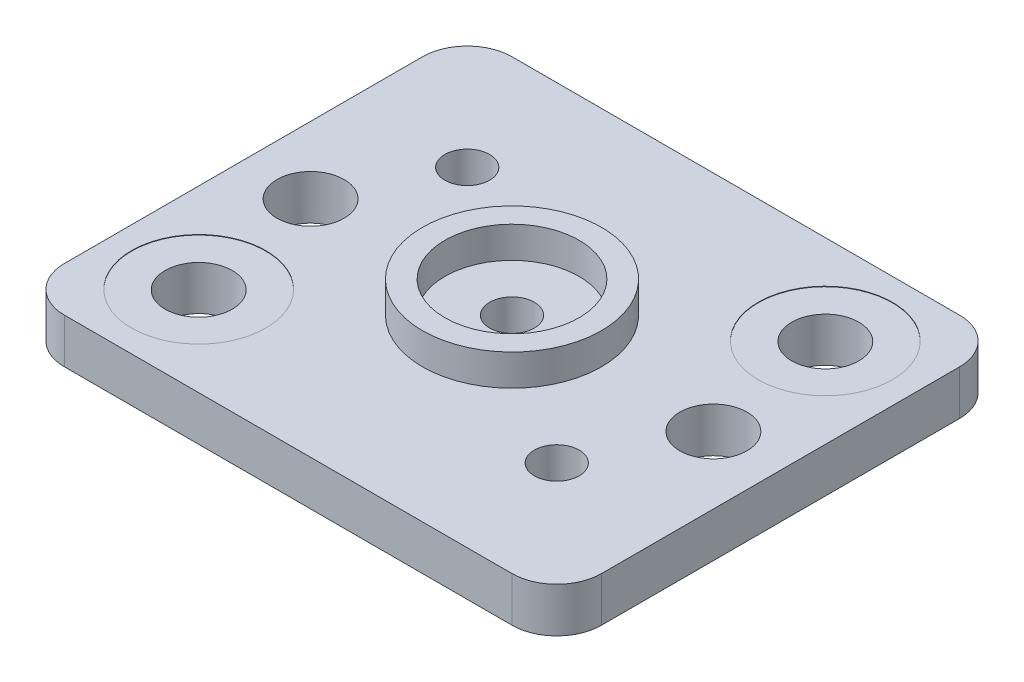
ISO-10303-21;
HEADER;
FILE_DESCRIPTION(('STEP AP214'),'2;1');
FILE_NAME('part.step','',(''),(''),'','','');
FILE_SCHEMA(('AUTOMOTIVE_DESIGN { 1 0 10303 214 1 1 1 1 }'));
ENDSEC;
DATA;
#1=APPLICATION_CONTEXT('core data for automotive mechanical design processes');
#2=APPLICATION_PROTOCOL_DEFINITION('international standard','automotive_design',2000,#1);
#3=PRODUCT_CONTEXT('',#1,'mechanical');
#4=PRODUCT('Part','Part','',(#3));
#5=PRODUCT_RELATED_PRODUCT_CATEGORY('part','',(#4));
#6=PRODUCT_DEFINITION_FORMATION('','',#4);
#7=PRODUCT_DEFINITION_CONTEXT('part definition',#1,'design');
#8=PRODUCT_DEFINITION('design','',#6,#7);
#9=PRODUCT_DEFINITION_SHAPE('','',#8);
#10=(LENGTH_UNIT() NAMED_UNIT(*) SI_UNIT(.MILLI.,.METRE.));
#11=(NAMED_UNIT(*) PLANE_ANGLE_UNIT() SI_UNIT($,.RADIAN.));
#12=(NAMED_UNIT(*) SI_UNIT($,.STERADIAN.) SOLID_ANGLE_UNIT());
#13=UNCERTAINTY_MEASURE_WITH_UNIT(LENGTH_MEASURE(1.E-05),#10,'distance_accuracy_value','');
#14=(GEOMETRIC_REPRESENTATION_CONTEXT(3) GLOBAL_UNCERTAINTY_ASSIGNED_CONTEXT((#13)) GLOBAL_UNIT_ASSIGNED_CONTEXT((#10,
#11,#12)) REPRESENTATION_CONTEXT('',''));
#15=CARTESIAN_POINT('',(0.,0.,0.));
#16=DIRECTION('',(0.,0.,1.));
#17=DIRECTION('',(1.,0.,0.));
#18=AXIS2_PLACEMENT_3D('',#15,#16,#17);
#19=CARTESIAN_POINT('',(-6.,1.,-5.));
#20=DIRECTION('',(1.,0.,0.));
#21=DIRECTION('',(0.,0.,-1.));
#22=AXIS2_PLACEMENT_3D('',#19,#20,#21);
#23=PLANE('',#22);
#24=DIRECTION('',(0.,0.,1.));
#25=VECTOR('',#24,1.);
#26=CARTESIAN_POINT('',(-6.,0.,-5.));
#27=LINE('',#26,#25);
#28=CARTESIAN_POINT('',(-6.,0.,-4.));
#29=VERTEX_POINT('',#28);
#30=CARTESIAN_POINT('',(-6.,0.,4.));
#31=VERTEX_POINT('',#30);
#32=EDGE_CURVE('E141',#29,#31,#27,.T.);
#33=ORIENTED_EDGE('',*,*,#32,.T.);
#34=DIRECTION('',(0.,-1.,0.));
#35=VECTOR('',#34,1.);
#36=CARTESIAN_POINT('',(-6.,1.,4.));
#37=LINE('',#36,#35);
#38=CARTESIAN_POINT('',(-6.,1.,4.));
#39=VERTEX_POINT('',#38);
#40=EDGE_CURVE('E163',#31,#39,#37,.F.);
#41=ORIENTED_EDGE('',*,*,#40,.T.);
#42=DIRECTION('',(0.,0.,1.));
#43=VECTOR('',#42,1.);
#44=CARTESIAN_POINT('',(-6.,1.,-5.));
#45=LINE('',#44,#43);
#46=CARTESIAN_POINT('',(-6.,1.,-4.));
#47=VERTEX_POINT('',#46);
#48=EDGE_CURVE('E139',#47,#39,#45,.T.);
#49=ORIENTED_EDGE('',*,*,#48,.F.);
#50=DIRECTION('',(0.,-1.,0.));
#51=VECTOR('',#50,1.);
#52=CARTESIAN_POINT('',(-6.,1.,-4.));
#53=LINE('',#52,#51);
#54=EDGE_CURVE('E160',#47,#29,#53,.T.);
#55=ORIENTED_EDGE('',*,*,#54,.T.);
#56=EDGE_LOOP('',(#33,#41,#49,#55));
#57=FACE_BOUND('',#56,.T.);
#58=ADVANCED_FACE('F42',(#57),#23,.F.);
#59=CARTESIAN_POINT('',(1.5,1.,5.));
#60=DIRECTION('',(0.,0.,-1.));
#61=DIRECTION('',(-1.,0.,0.));
#62=AXIS2_PLACEMENT_3D('',#59,#60,#61);
#63=PLANE('',#62);
#64=DIRECTION('',(1.,0.,0.));
#65=VECTOR('',#64,1.);
#66=CARTESIAN_POINT('',(1.5,0.,5.));
#67=LINE('',#66,#65);
#68=CARTESIAN_POINT('',(-5.,0.,5.));
#69=VERTEX_POINT('',#68);
#70=CARTESIAN_POINT('',(5.,0.,5.));
#71=VERTEX_POINT('',#70);
#72=EDGE_CURVE('E137',#69,#71,#67,.T.);
#73=ORIENTED_EDGE('',*,*,#72,.T.);
#74=DIRECTION('',(0.,-1.,0.));
#75=VECTOR('',#74,1.);
#76=CARTESIAN_POINT('',(5.,1.,5.));
#77=LINE('',#76,#75);
#78=CARTESIAN_POINT('',(5.,1.,5.));
#79=VERTEX_POINT('',#78);
#80=EDGE_CURVE('E115',#71,#79,#77,.F.);
#81=ORIENTED_EDGE('',*,*,#80,.T.);
#82=DIRECTION('',(1.,0.,0.));
#83=VECTOR('',#82,1.);
#84=CARTESIAN_POINT('',(-6.,1.,5.));
#85=LINE('',#84,#83);
#86=CARTESIAN_POINT('',(-5.,1.,5.));
#87=VERTEX_POINT('',#86);
#88=EDGE_CURVE('E209',#87,#79,#85,.T.);
#89=ORIENTED_EDGE('',*,*,#88,.F.);
#90=DIRECTION('',(0.,-1.,0.));
#91=VECTOR('',#90,1.);
#92=CARTESIAN_POINT('',(-5.,1.,5.));
#93=LINE('',#92,#91);
#94=EDGE_CURVE('E120',#87,#69,#93,.T.);
#95=ORIENTED_EDGE('',*,*,#94,.T.);
#96=EDGE_LOOP('',(#73,#81,#89,#95));
#97=FACE_BOUND('',#96,.T.);
#98=ADVANCED_FACE('F226',(#97),#63,.F.);
#99=CARTESIAN_POINT('',(6.,1.,-5.));
#100=DIRECTION('',(-1.,0.,0.));
#101=DIRECTION('',(0.,0.,1.));
#102=AXIS2_PLACEMENT_3D('',#99,#100,#101);
#103=PLANE('',#102);
#104=DIRECTION('',(0.,0.,-1.));
#105=VECTOR('',#104,1.);
#106=CARTESIAN_POINT('',(6.,1.,5.));
#107=LINE('',#106,#105);
#108=CARTESIAN_POINT('',(6.,1.,4.));
#109=VERTEX_POINT('',#108);
#110=CARTESIAN_POINT('',(6.,1.,-4.));
#111=VERTEX_POINT('',#110);
#112=EDGE_CURVE('E129',#109,#111,#107,.T.);
#113=ORIENTED_EDGE('',*,*,#112,.F.);
#114=DIRECTION('',(0.,-1.,0.));
#115=VECTOR('',#114,1.);
#116=CARTESIAN_POINT('',(6.,1.,4.));
#117=LINE('',#116,#115);
#118=CARTESIAN_POINT('',(6.,0.,4.));
#119=VERTEX_POINT('',#118);
#120=EDGE_CURVE('E114',#109,#119,#117,.T.);
#121=ORIENTED_EDGE('',*,*,#120,.T.);
#122=DIRECTION('',(0.,0.,-1.));
#123=VECTOR('',#122,1.);
#124=CARTESIAN_POINT('',(6.,0.,-5.));
#125=LINE('',#124,#123);
#126=CARTESIAN_POINT('',(6.,0.,-4.));
#127=VERTEX_POINT('',#126);
#128=EDGE_CURVE('E127',#119,#127,#125,.T.);
#129=ORIENTED_EDGE('',*,*,#128,.T.);
#130=DIRECTION('',(0.,-1.,0.));
#131=VECTOR('',#130,1.);
#132=CARTESIAN_POINT('',(6.,1.,-4.));
#133=LINE('',#132,#131);
#134=EDGE_CURVE('E131',#127,#111,#133,.F.);
#135=ORIENTED_EDGE('',*,*,#134,.T.);
#136=EDGE_LOOP('',(#113,#121,#129,#135));
#137=FACE_BOUND('',#136,.T.);
#138=ADVANCED_FACE('F126',(#137),#103,.F.);
#139=CARTESIAN_POINT('',(-6.,1.,-5.));
#140=DIRECTION('',(0.,0.,1.));
#141=DIRECTION('',(1.,0.,0.));
#142=AXIS2_PLACEMENT_3D('',#139,#140,#141);
#143=PLANE('',#142);
#144=DIRECTION('',(-1.,0.,0.));
#145=VECTOR('',#144,1.);
#146=CARTESIAN_POINT('',(-6.,1.,-5.));
#147=LINE('',#146,#145);
#148=CARTESIAN_POINT('',(5.,1.,-5.));
#149=VERTEX_POINT('',#148);
#150=CARTESIAN_POINT('',(-5.,1.,-5.));
#151=VERTEX_POINT('',#150);
#152=EDGE_CURVE('E145',#149,#151,#147,.T.);
#153=ORIENTED_EDGE('',*,*,#152,.F.);
#154=DIRECTION('',(0.,-1.,0.));
#155=VECTOR('',#154,1.);
#156=CARTESIAN_POINT('',(5.,1.,-5.));
#157=LINE('',#156,#155);
#158=CARTESIAN_POINT('',(5.,0.,-5.));
#159=VERTEX_POINT('',#158);
#160=EDGE_CURVE('E11',#149,#159,#157,.T.);
#161=ORIENTED_EDGE('',*,*,#160,.T.);
#162=DIRECTION('',(-1.,0.,0.));
#163=VECTOR('',#162,1.);
#164=CARTESIAN_POINT('',(-6.,0.,-5.));
#165=LINE('',#164,#163);
#166=CARTESIAN_POINT('',(-5.,0.,-5.));
#167=VERTEX_POINT('',#166);
#168=EDGE_CURVE('E136',#159,#167,#165,.T.);
#169=ORIENTED_EDGE('',*,*,#168,.T.);
#170=DIRECTION('',(0.,-1.,0.));
#171=VECTOR('',#170,1.);
#172=CARTESIAN_POINT('',(-5.,1.,-5.));
#173=LINE('',#172,#171);
#174=EDGE_CURVE('E51',#167,#151,#173,.F.);
#175=ORIENTED_EDGE('',*,*,#174,.T.);
#176=EDGE_LOOP('',(#153,#161,#169,#175));
#177=FACE_BOUND('',#176,.T.);
#178=ADVANCED_FACE('F233',(#177),#143,.F.);
#179=CARTESIAN_POINT('',(0.,1.,0.));
#180=DIRECTION('',(0.,1.,0.));
#181=DIRECTION('',(0.,0.,1.));
#182=AXIS2_PLACEMENT_3D('',#179,#180,#181);
#183=PLANE('',#182);
#184=CARTESIAN_POINT('',(0.,1.,0.));
#185=DIRECTION('',(0.,1.,0.));
#186=DIRECTION('',(0.,0.,1.));
#187=AXIS2_PLACEMENT_3D('',#184,#185,#186);
#188=CIRCLE('',#187,2.);
#189=CARTESIAN_POINT('',(0.,1.,2.));
#190=VERTEX_POINT('',#189);
#191=EDGE_CURVE('E333',#190,#190,#188,.T.);
#192=ORIENTED_EDGE('',*,*,#191,.F.);
#193=EDGE_LOOP('',(#192));
#194=FACE_BOUND('',#193,.T.);
#195=CARTESIAN_POINT('',(-3.36,1.,-2.36));
#196=DIRECTION('',(0.,1.,0.));
#197=DIRECTION('',(0.,0.,1.));
#198=AXIS2_PLACEMENT_3D('',#195,#196,#197);
#199=CIRCLE('',#198,0.5);
#200=CARTESIAN_POINT('',(-3.36,1.,-1.86));
#201=VERTEX_POINT('',#200);
#202=EDGE_CURVE('E338',#201,#201,#199,.T.);
#203=ORIENTED_EDGE('',*,*,#202,.F.);
#204=EDGE_LOOP('',(#203));
#205=FACE_BOUND('',#204,.T.);
#206=CARTESIAN_POINT('',(3.36,1.,2.36));
#207=DIRECTION('',(0.,1.,0.));
#208=DIRECTION('',(0.,0.,1.));
#209=AXIS2_PLACEMENT_3D('',#206,#207,#208);
#210=CIRCLE('',#209,0.5);
#211=CARTESIAN_POINT('',(3.36,1.,2.86));
#212=VERTEX_POINT('',#211);
#213=EDGE_CURVE('E344',#212,#212,#210,.T.);
#214=ORIENTED_EDGE('',*,*,#213,.F.);
#215=EDGE_LOOP('',(#214));
#216=FACE_BOUND('',#215,.T.);
#217=CARTESIAN_POINT('',(-4.5,1.,0.));
#218=DIRECTION('',(0.,1.,0.));
#219=DIRECTION('',(0.,0.,-1.));
#220=AXIS2_PLACEMENT_3D('',#217,#218,#219);
#221=CIRCLE('',#220,0.749999999999999);
#222=CARTESIAN_POINT('',(-4.5,1.,-0.749999999999999));
#223=VERTEX_POINT('',#222);
#224=EDGE_CURVE('E341',#223,#223,#221,.T.);
#225=ORIENTED_EDGE('',*,*,#224,.F.);
#226=EDGE_LOOP('',(#225));
#227=FACE_BOUND('',#226,.T.);
#228=CARTESIAN_POINT('',(4.5,1.,0.));
#229=DIRECTION('',(0.,1.,0.));
#230=DIRECTION('',(0.,0.,1.));
#231=AXIS2_PLACEMENT_3D('',#228,#229,#230);
#232=CIRCLE('',#231,0.749999999999999);
#233=CARTESIAN_POINT('',(4.5,1.,0.749999999999999));
#234=VERTEX_POINT('',#233);
#235=EDGE_CURVE('E178',#234,#234,#232,.T.);
#236=ORIENTED_EDGE('',*,*,#235,.F.);
#237=EDGE_LOOP('',(#236));
#238=FACE_BOUND('',#237,.T.);
#239=CARTESIAN_POINT('',(4.,1.,-3.));
#240=DIRECTION('',(0.,1.,0.));
#241=DIRECTION('',(0.,0.,1.));
#242=AXIS2_PLACEMENT_3D('',#239,#240,#241);
#243=CIRCLE('',#242,1.5);
#244=CARTESIAN_POINT('',(4.,1.,-1.5));
#245=VERTEX_POINT('',#244);
#246=EDGE_CURVE('E199',#245,#245,#243,.T.);
#247=ORIENTED_EDGE('',*,*,#246,.F.);
#248=EDGE_LOOP('',(#247));
#249=FACE_BOUND('',#248,.T.);
#250=CARTESIAN_POINT('',(-4.,1.,3.));
#251=DIRECTION('',(0.,1.,0.));
#252=DIRECTION('',(0.,0.,1.));
#253=AXIS2_PLACEMENT_3D('',#250,#251,#252);
#254=CIRCLE('',#253,1.5);
#255=CARTESIAN_POINT('',(-4.,1.,4.5));
#256=VERTEX_POINT('',#255);
#257=EDGE_CURVE('E173',#256,#256,#254,.T.);
#258=ORIENTED_EDGE('',*,*,#257,.F.);
#259=EDGE_LOOP('',(#258));
#260=FACE_BOUND('',#259,.T.);
#261=ORIENTED_EDGE('',*,*,#88,.T.);
#262=CARTESIAN_POINT('',(5.,1.,4.));
#263=DIRECTION('',(0.,1.,0.));
#264=DIRECTION('',(0.,0.,1.));
#265=AXIS2_PLACEMENT_3D('',#262,#263,#264);
#266=CIRCLE('',#265,1.);
#267=EDGE_CURVE('E158',#79,#109,#266,.T.);
#268=ORIENTED_EDGE('',*,*,#267,.T.);
#269=ORIENTED_EDGE('',*,*,#112,.T.);
#270=CARTESIAN_POINT('',(5.,1.,-4.));
#271=DIRECTION('',(0.,1.,0.));
#272=DIRECTION('',(0.,0.,1.));
#273=AXIS2_PLACEMENT_3D('',#270,#271,#272);
#274=CIRCLE('',#273,1.);
#275=EDGE_CURVE('E65',#111,#149,#274,.T.);
#276=ORIENTED_EDGE('',*,*,#275,.T.);
#277=ORIENTED_EDGE('',*,*,#152,.T.);
#278=CARTESIAN_POINT('',(-5.,1.,-4.));
#279=DIRECTION('',(0.,1.,0.));
#280=DIRECTION('',(0.,0.,1.));
#281=AXIS2_PLACEMENT_3D('',#278,#279,#280);
#282=CIRCLE('',#281,1.);
#283=EDGE_CURVE('E153',#151,#47,#282,.T.);
#284=ORIENTED_EDGE('',*,*,#283,.T.);
#285=ORIENTED_EDGE('',*,*,#48,.T.);
#286=CARTESIAN_POINT('',(-5.,1.,4.));
#287=DIRECTION('',(0.,1.,0.));
#288=DIRECTION('',(0.,0.,1.));
#289=AXIS2_PLACEMENT_3D('',#286,#287,#288);
#290=CIRCLE('',#289,1.);
#291=EDGE_CURVE('E156',#39,#87,#290,.T.);
#292=ORIENTED_EDGE('',*,*,#291,.T.);
#293=EDGE_LOOP('',(#261,#268,#269,#276,#277,#284,#285,#292));
#294=FACE_BOUND('',#293,.T.);
#295=ADVANCED_FACE('F224',(#194,#205,#216,#227,#238,#249,#260,#294),#183,.T.);
#296=CARTESIAN_POINT('',(0.,0.,0.));
#297=DIRECTION('',(0.,1.,0.));
#298=DIRECTION('',(0.,0.,1.));
#299=AXIS2_PLACEMENT_3D('',#296,#297,#298);
#300=PLANE('',#299);
#301=CARTESIAN_POINT('',(0.,0.,0.));
#302=DIRECTION('',(0.,1.,0.));
#303=DIRECTION('',(0.,0.,1.));
#304=AXIS2_PLACEMENT_3D('',#301,#302,#303);
#305=CIRCLE('',#304,0.5);
#306=CARTESIAN_POINT('',(0.,0.,0.5));
#307=VERTEX_POINT('',#306);
#308=EDGE_CURVE('E46',#307,#307,#305,.T.);
#309=ORIENTED_EDGE('',*,*,#308,.T.);
#310=EDGE_LOOP('',(#309));
#311=FACE_BOUND('',#310,.T.);
#312=CARTESIAN_POINT('',(-3.36,0.,-2.36));
#313=DIRECTION('',(0.,1.,0.));
#314=DIRECTION('',(0.,0.,1.));
#315=AXIS2_PLACEMENT_3D('',#312,#313,#314);
#316=CIRCLE('',#315,0.5);
#317=CARTESIAN_POINT('',(-3.36,0.,-1.86));
#318=VERTEX_POINT('',#317);
#319=EDGE_CURVE('E183',#318,#318,#316,.T.);
#320=ORIENTED_EDGE('',*,*,#319,.T.);
#321=EDGE_LOOP('',(#320));
#322=FACE_BOUND('',#321,.T.);
#323=CARTESIAN_POINT('',(3.36,0.,2.36));
#324=DIRECTION('',(0.,1.,0.));
#325=DIRECTION('',(0.,0.,1.));
#326=AXIS2_PLACEMENT_3D('',#323,#324,#325);
#327=CIRCLE('',#326,0.5);
#328=CARTESIAN_POINT('',(3.36,0.,2.86));
#329=VERTEX_POINT('',#328);
#330=EDGE_CURVE('E181',#329,#329,#327,.T.);
#331=ORIENTED_EDGE('',*,*,#330,.T.);
#332=EDGE_LOOP('',(#331));
#333=FACE_BOUND('',#332,.T.);
#334=CARTESIAN_POINT('',(-4.5,0.,0.));
#335=DIRECTION('',(0.,1.,0.));
#336=DIRECTION('',(0.,0.,1.));
#337=AXIS2_PLACEMENT_3D('',#334,#335,#336);
#338=CIRCLE('',#337,0.749999999999999);
#339=CARTESIAN_POINT('',(-4.5,0.,0.749999999999999));
#340=VERTEX_POINT('',#339);
#341=EDGE_CURVE('E177',#340,#340,#338,.T.);
#342=ORIENTED_EDGE('',*,*,#341,.T.);
#343=EDGE_LOOP('',(#342));
#344=FACE_BOUND('',#343,.T.);
#345=CARTESIAN_POINT('',(4.5,0.,0.));
#346=DIRECTION('',(0.,1.,0.));
#347=DIRECTION('',(0.,0.,1.));
#348=AXIS2_PLACEMENT_3D('',#345,#346,#347);
#349=CIRCLE('',#348,0.749999999999999);
#350=CARTESIAN_POINT('',(4.5,0.,0.749999999999999));
#351=VERTEX_POINT('',#350);
#352=EDGE_CURVE('E174',#351,#351,#349,.T.);
#353=ORIENTED_EDGE('',*,*,#352,.T.);
#354=EDGE_LOOP('',(#353));
#355=FACE_BOUND('',#354,.T.);
#356=CARTESIAN_POINT('',(4.,0.,-3.));
#357=DIRECTION('',(0.,1.,0.));
#358=DIRECTION('',(0.,0.,1.));
#359=AXIS2_PLACEMENT_3D('',#356,#357,#358);
#360=CIRCLE('',#359,0.75);
#361=CARTESIAN_POINT('',(4.,0.,-2.25));
#362=VERTEX_POINT('',#361);
#363=EDGE_CURVE('E169',#362,#362,#360,.T.);
#364=ORIENTED_EDGE('',*,*,#363,.T.);
#365=EDGE_LOOP('',(#364));
#366=FACE_BOUND('',#365,.T.);
#367=CARTESIAN_POINT('',(-4.,0.,3.));
#368=DIRECTION('',(0.,1.,0.));
#369=DIRECTION('',(0.,0.,1.));
#370=AXIS2_PLACEMENT_3D('',#367,#368,#369);
#371=CIRCLE('',#370,0.75);
#372=CARTESIAN_POINT('',(-4.,0.,3.75));
#373=VERTEX_POINT('',#372);
#374=EDGE_CURVE('E166',#373,#373,#371,.T.);
#375=ORIENTED_EDGE('',*,*,#374,.T.);
#376=EDGE_LOOP('',(#375));
#377=FACE_BOUND('',#376,.T.);
#378=ORIENTED_EDGE('',*,*,#128,.F.);
#379=CARTESIAN_POINT('',(5.,0.,4.));
#380=DIRECTION('',(0.,1.,0.));
#381=DIRECTION('',(0.,0.,1.));
#382=AXIS2_PLACEMENT_3D('',#379,#380,#381);
#383=CIRCLE('',#382,1.);
#384=EDGE_CURVE('E110',#119,#71,#383,.F.);
#385=ORIENTED_EDGE('',*,*,#384,.T.);
#386=ORIENTED_EDGE('',*,*,#72,.F.);
#387=CARTESIAN_POINT('',(-5.,0.,4.));
#388=DIRECTION('',(0.,1.,0.));
#389=DIRECTION('',(0.,0.,1.));
#390=AXIS2_PLACEMENT_3D('',#387,#388,#389);
#391=CIRCLE('',#390,1.);
#392=EDGE_CURVE('E121',#69,#31,#391,.F.);
#393=ORIENTED_EDGE('',*,*,#392,.T.);
#394=ORIENTED_EDGE('',*,*,#32,.F.);
#395=CARTESIAN_POINT('',(-5.,0.,-4.));
#396=DIRECTION('',(0.,1.,0.));
#397=DIRECTION('',(0.,0.,1.));
#398=AXIS2_PLACEMENT_3D('',#395,#396,#397);
#399=CIRCLE('',#398,1.);
#400=EDGE_CURVE('E130',#29,#167,#399,.F.);
#401=ORIENTED_EDGE('',*,*,#400,.T.);
#402=ORIENTED_EDGE('',*,*,#168,.F.);
#403=CARTESIAN_POINT('',(5.,0.,-4.));
#404=DIRECTION('',(0.,1.,0.));
#405=DIRECTION('',(0.,0.,1.));
#406=AXIS2_PLACEMENT_3D('',#403,#404,#405);
#407=CIRCLE('',#406,1.);
#408=EDGE_CURVE('E135',#159,#127,#407,.F.);
#409=ORIENTED_EDGE('',*,*,#408,.T.);
#410=EDGE_LOOP('',(#378,#385,#386,#393,#394,#401,#402,#409));
#411=FACE_BOUND('',#410,.T.);
#412=ADVANCED_FACE('F133',(#311,#322,#333,#344,#355,#366,#377,#411),#300,.F.);
#413=CARTESIAN_POINT('',(5.,1.,4.));
#414=DIRECTION('',(0.,-1.,0.));
#415=DIRECTION('',(0.,0.,-1.));
#416=AXIS2_PLACEMENT_3D('',#413,#414,#415);
#417=CYLINDRICAL_SURFACE('',#416,1.);
#418=ORIENTED_EDGE('',*,*,#267,.F.);
#419=ORIENTED_EDGE('',*,*,#80,.F.);
#420=ORIENTED_EDGE('',*,*,#384,.F.);
#421=ORIENTED_EDGE('',*,*,#120,.F.);
#422=EDGE_LOOP('',(#418,#419,#420,#421));
#423=FACE_BOUND('',#422,.T.);
#424=ADVANCED_FACE('F113',(#423),#417,.T.);
#425=CARTESIAN_POINT('',(-5.,1.,4.));
#426=DIRECTION('',(0.,-1.,0.));
#427=DIRECTION('',(0.,0.,-1.));
#428=AXIS2_PLACEMENT_3D('',#425,#426,#427);
#429=CYLINDRICAL_SURFACE('',#428,1.);
#430=ORIENTED_EDGE('',*,*,#291,.F.);
#431=ORIENTED_EDGE('',*,*,#40,.F.);
#432=ORIENTED_EDGE('',*,*,#392,.F.);
#433=ORIENTED_EDGE('',*,*,#94,.F.);
#434=EDGE_LOOP('',(#430,#431,#432,#433));
#435=FACE_BOUND('',#434,.T.);
#436=ADVANCED_FACE('F221',(#435),#429,.T.);
#437=CARTESIAN_POINT('',(5.,1.,-4.));
#438=DIRECTION('',(0.,-1.,0.));
#439=DIRECTION('',(0.,0.,-1.));
#440=AXIS2_PLACEMENT_3D('',#437,#438,#439);
#441=CYLINDRICAL_SURFACE('',#440,1.);
#442=ORIENTED_EDGE('',*,*,#275,.F.);
#443=ORIENTED_EDGE('',*,*,#134,.F.);
#444=ORIENTED_EDGE('',*,*,#408,.F.);
#445=ORIENTED_EDGE('',*,*,#160,.F.);
#446=EDGE_LOOP('',(#442,#443,#444,#445));
#447=FACE_BOUND('',#446,.T.);
#448=ADVANCED_FACE('F241',(#447),#441,.T.);
#449=CARTESIAN_POINT('',(-5.,1.,-4.));
#450=DIRECTION('',(0.,-1.,0.));
#451=DIRECTION('',(0.,0.,-1.));
#452=AXIS2_PLACEMENT_3D('',#449,#450,#451);
#453=CYLINDRICAL_SURFACE('',#452,1.);
#454=ORIENTED_EDGE('',*,*,#283,.F.);
#455=ORIENTED_EDGE('',*,*,#174,.F.);
#456=ORIENTED_EDGE('',*,*,#400,.F.);
#457=ORIENTED_EDGE('',*,*,#54,.F.);
#458=EDGE_LOOP('',(#454,#455,#456,#457));
#459=FACE_BOUND('',#458,.T.);
#460=ADVANCED_FACE('F44',(#459),#453,.T.);
#461=CARTESIAN_POINT('',(-4.,0.99,3.));
#462=DIRECTION('',(0.,1.,0.));
#463=DIRECTION('',(0.,0.,1.));
#464=AXIS2_PLACEMENT_3D('',#461,#462,#463);
#465=CYLINDRICAL_SURFACE('',#464,1.5);
#466=CARTESIAN_POINT('',(-4.,0.99,3.));
#467=DIRECTION('',(0.,1.,0.));
#468=DIRECTION('',(0.,0.,1.));
#469=AXIS2_PLACEMENT_3D('',#466,#467,#468);
#470=CIRCLE('',#469,1.5);
#471=CARTESIAN_POINT('',(-4.,0.99,4.5));
#472=VERTEX_POINT('',#471);
#473=EDGE_CURVE('E202',#472,#472,#470,.T.);
#474=ORIENTED_EDGE('',*,*,#473,.F.);
#475=EDGE_LOOP('',(#474));
#476=FACE_BOUND('',#475,.T.);
#477=ORIENTED_EDGE('',*,*,#257,.T.);
#478=EDGE_LOOP('',(#477));
#479=FACE_BOUND('',#478,.T.);
#480=ADVANCED_FACE('F247',(#476,#479),#465,.F.);
#481=CARTESIAN_POINT('',(-4.,0.99,3.));
#482=DIRECTION('',(0.,1.,0.));
#483=DIRECTION('',(0.,0.,1.));
#484=AXIS2_PLACEMENT_3D('',#481,#482,#483);
#485=PLANE('',#484);
#486=CARTESIAN_POINT('',(-4.,0.99,3.));
#487=DIRECTION('',(0.,1.,0.));
#488=DIRECTION('',(0.,0.,1.));
#489=AXIS2_PLACEMENT_3D('',#486,#487,#488);
#490=CIRCLE('',#489,0.75);
#491=CARTESIAN_POINT('',(-4.,0.99,3.75));
#492=VERTEX_POINT('',#491);
#493=EDGE_CURVE('E185',#492,#492,#490,.T.);
#494=ORIENTED_EDGE('',*,*,#493,.F.);
#495=EDGE_LOOP('',(#494));
#496=FACE_BOUND('',#495,.T.);
#497=ORIENTED_EDGE('',*,*,#473,.T.);
#498=EDGE_LOOP('',(#497));
#499=FACE_BOUND('',#498,.T.);
#500=ADVANCED_FACE('F263',(#496,#499),#485,.T.);
#501=CARTESIAN_POINT('',(4.,0.99,-3.));
#502=DIRECTION('',(0.,1.,0.));
#503=DIRECTION('',(0.,0.,1.));
#504=AXIS2_PLACEMENT_3D('',#501,#502,#503);
#505=CYLINDRICAL_SURFACE('',#504,1.5);
#506=CARTESIAN_POINT('',(4.,0.99,-3.));
#507=DIRECTION('',(0.,1.,0.));
#508=DIRECTION('',(0.,0.,1.));
#509=AXIS2_PLACEMENT_3D('',#506,#507,#508);
#510=CIRCLE('',#509,1.5);
#511=CARTESIAN_POINT('',(4.,0.99,-1.5));
#512=VERTEX_POINT('',#511);
#513=EDGE_CURVE('E196',#512,#512,#510,.T.);
#514=ORIENTED_EDGE('',*,*,#513,.F.);
#515=EDGE_LOOP('',(#514));
#516=FACE_BOUND('',#515,.T.);
#517=ORIENTED_EDGE('',*,*,#246,.T.);
#518=EDGE_LOOP('',(#517));
#519=FACE_BOUND('',#518,.T.);
#520=ADVANCED_FACE('F267',(#516,#519),#505,.F.);
#521=CARTESIAN_POINT('',(4.,0.99,-3.));
#522=DIRECTION('',(0.,1.,0.));
#523=DIRECTION('',(0.,0.,1.));
#524=AXIS2_PLACEMENT_3D('',#521,#522,#523);
#525=PLANE('',#524);
#526=CARTESIAN_POINT('',(4.,0.99,-3.));
#527=DIRECTION('',(0.,1.,0.));
#528=DIRECTION('',(0.,0.,1.));
#529=AXIS2_PLACEMENT_3D('',#526,#527,#528);
#530=CIRCLE('',#529,0.75);
#531=CARTESIAN_POINT('',(4.,0.99,-2.25));
#532=VERTEX_POINT('',#531);
#533=EDGE_CURVE('E170',#532,#532,#530,.T.);
#534=ORIENTED_EDGE('',*,*,#533,.F.);
#535=EDGE_LOOP('',(#534));
#536=FACE_BOUND('',#535,.T.);
#537=ORIENTED_EDGE('',*,*,#513,.T.);
#538=EDGE_LOOP('',(#537));
#539=FACE_BOUND('',#538,.T.);
#540=ADVANCED_FACE('F271',(#536,#539),#525,.T.);
#541=CARTESIAN_POINT('',(-4.,-0.11,3.));
#542=DIRECTION('',(0.,1.,0.));
#543=DIRECTION('',(0.,0.,1.));
#544=AXIS2_PLACEMENT_3D('',#541,#542,#543);
#545=CYLINDRICAL_SURFACE('',#544,0.75);
#546=ORIENTED_EDGE('',*,*,#493,.T.);
#547=EDGE_LOOP('',(#546));
#548=FACE_BOUND('',#547,.T.);
#549=ORIENTED_EDGE('',*,*,#374,.F.);
#550=EDGE_LOOP('',(#549));
#551=FACE_BOUND('',#550,.T.);
#552=ADVANCED_FACE('F275',(#548,#551),#545,.F.);
#553=CARTESIAN_POINT('',(4.,-0.11,-3.));
#554=DIRECTION('',(0.,1.,0.));
#555=DIRECTION('',(0.,0.,1.));
#556=AXIS2_PLACEMENT_3D('',#553,#554,#555);
#557=CYLINDRICAL_SURFACE('',#556,0.75);
#558=ORIENTED_EDGE('',*,*,#533,.T.);
#559=EDGE_LOOP('',(#558));
#560=FACE_BOUND('',#559,.T.);
#561=ORIENTED_EDGE('',*,*,#363,.F.);
#562=EDGE_LOOP('',(#561));
#563=FACE_BOUND('',#562,.T.);
#564=ADVANCED_FACE('F279',(#560,#563),#557,.F.);
#565=CARTESIAN_POINT('',(4.5,-0.1,0.));
#566=DIRECTION('',(0.,1.,0.));
#567=DIRECTION('',(0.,0.,1.));
#568=AXIS2_PLACEMENT_3D('',#565,#566,#567);
#569=CYLINDRICAL_SURFACE('',#568,0.749999999999999);
#570=ORIENTED_EDGE('',*,*,#235,.T.);
#571=EDGE_LOOP('',(#570));
#572=FACE_BOUND('',#571,.T.);
#573=ORIENTED_EDGE('',*,*,#352,.F.);
#574=EDGE_LOOP('',(#573));
#575=FACE_BOUND('',#574,.T.);
#576=ADVANCED_FACE('F282',(#572,#575),#569,.F.);
#577=CARTESIAN_POINT('',(-4.5,-0.1,0.));
#578=DIRECTION('',(0.,1.,0.));
#579=DIRECTION('',(0.,0.,1.));
#580=AXIS2_PLACEMENT_3D('',#577,#578,#579);
#581=CYLINDRICAL_SURFACE('',#580,0.749999999999999);
#582=ORIENTED_EDGE('',*,*,#224,.T.);
#583=EDGE_LOOP('',(#582));
#584=FACE_BOUND('',#583,.T.);
#585=ORIENTED_EDGE('',*,*,#341,.F.);
#586=EDGE_LOOP('',(#585));
#587=FACE_BOUND('',#586,.T.);
#588=ADVANCED_FACE('F286',(#584,#587),#581,.F.);
#589=CARTESIAN_POINT('',(3.36,-0.1,2.36));
#590=DIRECTION('',(0.,1.,0.));
#591=DIRECTION('',(0.,0.,1.));
#592=AXIS2_PLACEMENT_3D('',#589,#590,#591);
#593=CYLINDRICAL_SURFACE('',#592,0.5);
#594=ORIENTED_EDGE('',*,*,#213,.T.);
#595=EDGE_LOOP('',(#594));
#596=FACE_BOUND('',#595,.T.);
#597=ORIENTED_EDGE('',*,*,#330,.F.);
#598=EDGE_LOOP('',(#597));
#599=FACE_BOUND('',#598,.T.);
#600=ADVANCED_FACE('F292',(#596,#599),#593,.F.);
#601=CARTESIAN_POINT('',(-3.36,-0.1,-2.36));
#602=DIRECTION('',(0.,1.,0.));
#603=DIRECTION('',(0.,0.,1.));
#604=AXIS2_PLACEMENT_3D('',#601,#602,#603);
#605=CYLINDRICAL_SURFACE('',#604,0.5);
#606=ORIENTED_EDGE('',*,*,#202,.T.);
#607=EDGE_LOOP('',(#606));
#608=FACE_BOUND('',#607,.T.);
#609=ORIENTED_EDGE('',*,*,#319,.F.);
#610=EDGE_LOOP('',(#609));
#611=FACE_BOUND('',#610,.T.);
#612=ADVANCED_FACE('F288',(#608,#611),#605,.F.);
#613=CARTESIAN_POINT('',(0.,1.7,0.));
#614=DIRECTION('',(0.,-1.,0.));
#615=DIRECTION('',(0.,0.,-1.));
#616=AXIS2_PLACEMENT_3D('',#613,#614,#615);
#617=CYLINDRICAL_SURFACE('',#616,2.);
#618=CARTESIAN_POINT('',(0.,1.7,0.));
#619=DIRECTION('',(0.,1.,0.));
#620=DIRECTION('',(0.,0.,1.));
#621=AXIS2_PLACEMENT_3D('',#618,#619,#620);
#622=CIRCLE('',#621,2.);
#623=CARTESIAN_POINT('',(0.,1.7,2.));
#624=VERTEX_POINT('',#623);
#625=EDGE_CURVE('E335',#624,#624,#622,.T.);
#626=ORIENTED_EDGE('',*,*,#625,.F.);
#627=EDGE_LOOP('',(#626));
#628=FACE_BOUND('',#627,.T.);
#629=ORIENTED_EDGE('',*,*,#191,.T.);
#630=EDGE_LOOP('',(#629));
#631=FACE_BOUND('',#630,.T.);
#632=ADVANCED_FACE('F291',(#628,#631),#617,.T.);
#633=CARTESIAN_POINT('',(0.,1.7,0.));
#634=DIRECTION('',(0.,1.,0.));
#635=DIRECTION('',(0.,0.,1.));
#636=AXIS2_PLACEMENT_3D('',#633,#634,#635);
#637=PLANE('',#636);
#638=CARTESIAN_POINT('',(0.,1.7,0.));
#639=DIRECTION('',(0.,1.,0.));
#640=DIRECTION('',(0.,0.,1.));
#641=AXIS2_PLACEMENT_3D('',#638,#639,#640);
#642=CIRCLE('',#641,1.5);
#643=CARTESIAN_POINT('',(0.,1.7,1.5));
#644=VERTEX_POINT('',#643);
#645=EDGE_CURVE('E326',#644,#644,#642,.T.);
#646=ORIENTED_EDGE('',*,*,#645,.F.);
#647=EDGE_LOOP('',(#646));
#648=FACE_BOUND('',#647,.T.);
#649=ORIENTED_EDGE('',*,*,#625,.T.);
#650=EDGE_LOOP('',(#649));
#651=FACE_BOUND('',#650,.T.);
#652=ADVANCED_FACE('F302',(#648,#651),#637,.T.);
#653=CARTESIAN_POINT('',(0.,1.,0.));
#654=DIRECTION('',(0.,1.,0.));
#655=DIRECTION('',(0.,0.,1.));
#656=AXIS2_PLACEMENT_3D('',#653,#654,#655);
#657=CYLINDRICAL_SURFACE('',#656,1.5);
#658=CARTESIAN_POINT('',(0.,1.,0.));
#659=DIRECTION('',(0.,1.,0.));
#660=DIRECTION('',(0.,0.,1.));
#661=AXIS2_PLACEMENT_3D('',#658,#659,#660);
#662=CIRCLE('',#661,1.5);
#663=CARTESIAN_POINT('',(0.,1.,1.5));
#664=VERTEX_POINT('',#663);
#665=EDGE_CURVE('E328',#664,#664,#662,.T.);
#666=ORIENTED_EDGE('',*,*,#665,.F.);
#667=EDGE_LOOP('',(#666));
#668=FACE_BOUND('',#667,.T.);
#669=ORIENTED_EDGE('',*,*,#645,.T.);
#670=EDGE_LOOP('',(#669));
#671=FACE_BOUND('',#670,.T.);
#672=ADVANCED_FACE('F306',(#668,#671),#657,.F.);
#673=CARTESIAN_POINT('',(0.,1.,0.));
#674=DIRECTION('',(0.,1.,0.));
#675=DIRECTION('',(0.,0.,1.));
#676=AXIS2_PLACEMENT_3D('',#673,#674,#675);
#677=PLANE('',#676);
#678=CARTESIAN_POINT('',(0.,1.,0.));
#679=DIRECTION('',(0.,1.,0.));
#680=DIRECTION('',(0.,0.,1.));
#681=AXIS2_PLACEMENT_3D('',#678,#679,#680);
#682=CIRCLE('',#681,0.5);
#683=CARTESIAN_POINT('',(0.,1.,0.5));
#684=VERTEX_POINT('',#683);
#685=EDGE_CURVE('E323',#684,#684,#682,.T.);
#686=ORIENTED_EDGE('',*,*,#685,.F.);
#687=EDGE_LOOP('',(#686));
#688=FACE_BOUND('',#687,.T.);
#689=ORIENTED_EDGE('',*,*,#665,.T.);
#690=EDGE_LOOP('',(#689));
#691=FACE_BOUND('',#690,.T.);
#692=ADVANCED_FACE('F310',(#688,#691),#677,.T.);
#693=CARTESIAN_POINT('',(0.,-7.,0.));
#694=DIRECTION('',(0.,1.,0.));
#695=DIRECTION('',(0.,0.,1.));
#696=AXIS2_PLACEMENT_3D('',#693,#694,#695);
#697=CYLINDRICAL_SURFACE('',#696,0.5);
#698=ORIENTED_EDGE('',*,*,#685,.T.);
#699=EDGE_LOOP('',(#698));
#700=FACE_BOUND('',#699,.T.);
#701=ORIENTED_EDGE('',*,*,#308,.F.);
#702=EDGE_LOOP('',(#701));
#703=FACE_BOUND('',#702,.T.);
#704=ADVANCED_FACE('F314',(#700,#703),#697,.F.);
#705=CLOSED_SHELL('',(#58,#98,#138,#178,#295,#412,#424,#436,#448,#460,#480,#500,#520,#540,#552,
#564,#576,#588,#600,#612,#632,#652,#672,#692,#704));
#706=MANIFOLD_SOLID_BREP('B2',#705);
#707=ADVANCED_BREP_SHAPE_REPRESENTATION('',(#18,#706),#14);
#708=SHAPE_DEFINITION_REPRESENTATION(#9,#707);
ENDSEC;
END-ISO-10303-21;
